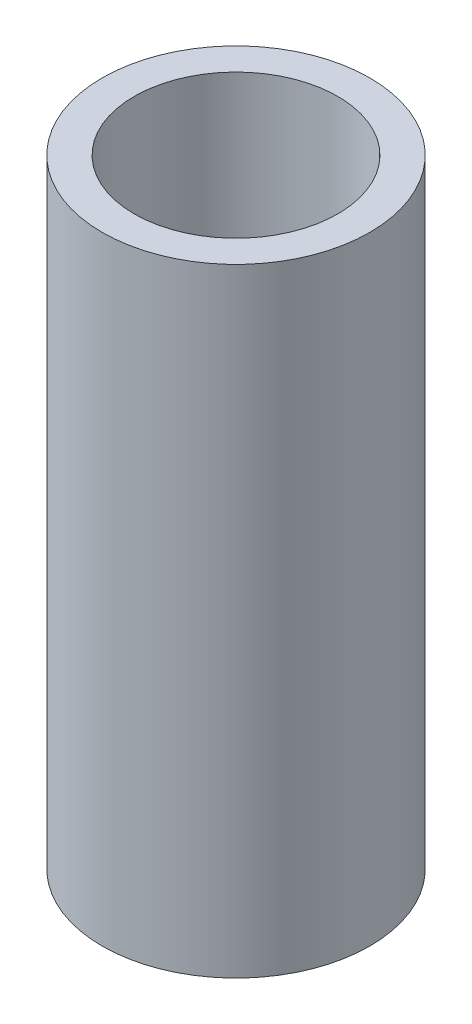
ISO-10303-21;
HEADER;
FILE_DESCRIPTION(('STEP AP214'),'2;1');
FILE_NAME('part.step','',(''),(''),'','','');
FILE_SCHEMA(('AUTOMOTIVE_DESIGN { 1 0 10303 214 1 1 1 1 }'));
ENDSEC;
DATA;
#1=APPLICATION_CONTEXT('core data for automotive mechanical design processes');
#2=APPLICATION_PROTOCOL_DEFINITION('international standard','automotive_design',2000,#1);
#3=PRODUCT_CONTEXT('',#1,'mechanical');
#4=PRODUCT('Part','Part','',(#3));
#5=PRODUCT_RELATED_PRODUCT_CATEGORY('part','',(#4));
#6=PRODUCT_DEFINITION_FORMATION('','',#4);
#7=PRODUCT_DEFINITION_CONTEXT('part definition',#1,'design');
#8=PRODUCT_DEFINITION('design','',#6,#7);
#9=PRODUCT_DEFINITION_SHAPE('','',#8);
#10=(LENGTH_UNIT() NAMED_UNIT(*) SI_UNIT(.MILLI.,.METRE.));
#11=(NAMED_UNIT(*) PLANE_ANGLE_UNIT() SI_UNIT($,.RADIAN.));
#12=(NAMED_UNIT(*) SI_UNIT($,.STERADIAN.) SOLID_ANGLE_UNIT());
#13=UNCERTAINTY_MEASURE_WITH_UNIT(LENGTH_MEASURE(1.E-05),#10,'distance_accuracy_value','');
#14=(GEOMETRIC_REPRESENTATION_CONTEXT(3) GLOBAL_UNCERTAINTY_ASSIGNED_CONTEXT((#13)) GLOBAL_UNIT_ASSIGNED_CONTEXT((#10,
#11,#12)) REPRESENTATION_CONTEXT('',''));
#15=CARTESIAN_POINT('',(0.,0.,0.));
#16=DIRECTION('',(0.,0.,1.));
#17=DIRECTION('',(1.,0.,0.));
#18=AXIS2_PLACEMENT_3D('',#15,#16,#17);
#19=CARTESIAN_POINT('',(0.,57.7375860645524,0.));
#20=DIRECTION('',(0.,-1.,0.));
#21=DIRECTION('',(0.,0.,-1.));
#22=AXIS2_PLACEMENT_3D('',#19,#20,#21);
#23=CYLINDRICAL_SURFACE('',#22,12.5);
#24=CARTESIAN_POINT('',(0.,57.7375860645524,0.));
#25=DIRECTION('',(0.,1.,0.));
#26=DIRECTION('',(0.,0.,1.));
#27=AXIS2_PLACEMENT_3D('',#24,#25,#26);
#28=CIRCLE('',#27,12.5);
#29=CARTESIAN_POINT('',(0.,57.7375860645524,12.5));
#30=VERTEX_POINT('',#29);
#31=EDGE_CURVE('E10',#30,#30,#28,.T.);
#32=ORIENTED_EDGE('',*,*,#31,.F.);
#33=EDGE_LOOP('',(#32));
#34=FACE_BOUND('',#33,.T.);
#35=CARTESIAN_POINT('',(0.,0.,0.));
#36=DIRECTION('',(0.,1.,0.));
#37=DIRECTION('',(0.,0.,1.));
#38=AXIS2_PLACEMENT_3D('',#35,#36,#37);
#39=CIRCLE('',#38,12.5);
#40=CARTESIAN_POINT('',(0.,0.,12.5));
#41=VERTEX_POINT('',#40);
#42=EDGE_CURVE('E37',#41,#41,#39,.T.);
#43=ORIENTED_EDGE('',*,*,#42,.T.);
#44=EDGE_LOOP('',(#43));
#45=FACE_BOUND('',#44,.T.);
#46=ADVANCED_FACE('F40',(#34,#45),#23,.T.);
#47=CARTESIAN_POINT('',(0.,57.7375860645524,0.));
#48=DIRECTION('',(0.,1.,0.));
#49=DIRECTION('',(0.,0.,1.));
#50=AXIS2_PLACEMENT_3D('',#47,#48,#49);
#51=PLANE('',#50);
#52=CARTESIAN_POINT('',(0.,57.7375860645524,0.));
#53=DIRECTION('',(0.,1.,0.));
#54=DIRECTION('',(0.,0.,1.));
#55=AXIS2_PLACEMENT_3D('',#52,#53,#54);
#56=CIRCLE('',#55,9.50957172421365);
#57=CARTESIAN_POINT('',(0.,57.7375860645524,9.50957172421365));
#58=VERTEX_POINT('',#57);
#59=EDGE_CURVE('E50',#58,#58,#56,.T.);
#60=ORIENTED_EDGE('',*,*,#59,.F.);
#61=EDGE_LOOP('',(#60));
#62=FACE_BOUND('',#61,.T.);
#63=ORIENTED_EDGE('',*,*,#31,.T.);
#64=EDGE_LOOP('',(#63));
#65=FACE_BOUND('',#64,.T.);
#66=ADVANCED_FACE('F59',(#62,#65),#51,.T.);
#67=CARTESIAN_POINT('',(0.,0.,0.));
#68=DIRECTION('',(0.,1.,0.));
#69=DIRECTION('',(0.,0.,1.));
#70=AXIS2_PLACEMENT_3D('',#67,#68,#69);
#71=PLANE('',#70);
#72=CARTESIAN_POINT('',(0.,0.,0.));
#73=DIRECTION('',(0.,1.,0.));
#74=DIRECTION('',(0.,0.,1.));
#75=AXIS2_PLACEMENT_3D('',#72,#73,#74);
#76=CIRCLE('',#75,9.50957172421365);
#77=CARTESIAN_POINT('',(0.,0.,9.50957172421365));
#78=VERTEX_POINT('',#77);
#79=EDGE_CURVE('E47',#78,#78,#76,.T.);
#80=ORIENTED_EDGE('',*,*,#79,.T.);
#81=EDGE_LOOP('',(#80));
#82=FACE_BOUND('',#81,.T.);
#83=ORIENTED_EDGE('',*,*,#42,.F.);
#84=EDGE_LOOP('',(#83));
#85=FACE_BOUND('',#84,.T.);
#86=ADVANCED_FACE('F58',(#82,#85),#71,.F.);
#87=CARTESIAN_POINT('',(0.,57.7375860645524,0.));
#88=DIRECTION('',(0.,-1.,0.));
#89=DIRECTION('',(0.,0.,-1.));
#90=AXIS2_PLACEMENT_3D('',#87,#88,#89);
#91=CYLINDRICAL_SURFACE('',#90,9.50957172421365);
#92=ORIENTED_EDGE('',*,*,#59,.T.);
#93=EDGE_LOOP('',(#92));
#94=FACE_BOUND('',#93,.T.);
#95=ORIENTED_EDGE('',*,*,#79,.F.);
#96=EDGE_LOOP('',(#95));
#97=FACE_BOUND('',#96,.T.);
#98=ADVANCED_FACE('F54',(#94,#97),#91,.F.);
#99=CLOSED_SHELL('',(#46,#66,#86,#98));
#100=MANIFOLD_SOLID_BREP('B2',#99);
#101=ADVANCED_BREP_SHAPE_REPRESENTATION('',(#18,#100),#14);
#102=SHAPE_DEFINITION_REPRESENTATION(#9,#101);
ENDSEC;
END-ISO-10303-21;
